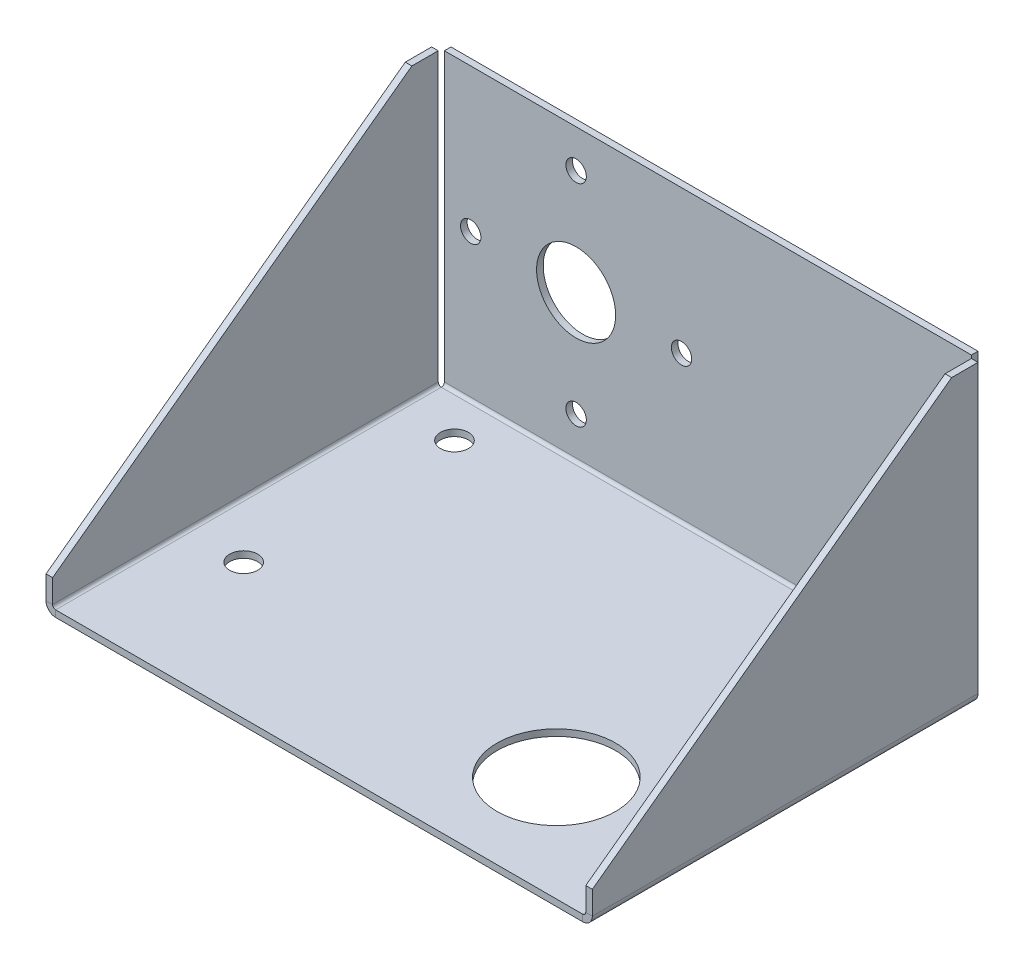
ISO-10303-21;
HEADER;
FILE_DESCRIPTION(('STEP AP214'),'2;1');
FILE_NAME('part.step','',(''),(''),'','','');
FILE_SCHEMA(('AUTOMOTIVE_DESIGN { 1 0 10303 214 1 1 1 1 }'));
ENDSEC;
DATA;
#1=APPLICATION_CONTEXT('core data for automotive mechanical design processes');
#2=APPLICATION_PROTOCOL_DEFINITION('international standard','automotive_design',2000,#1);
#3=PRODUCT_CONTEXT('',#1,'mechanical');
#4=PRODUCT('Part','Part','',(#3));
#5=PRODUCT_RELATED_PRODUCT_CATEGORY('part','',(#4));
#6=PRODUCT_DEFINITION_FORMATION('','',#4);
#7=PRODUCT_DEFINITION_CONTEXT('part definition',#1,'design');
#8=PRODUCT_DEFINITION('design','',#6,#7);
#9=PRODUCT_DEFINITION_SHAPE('','',#8);
#10=(LENGTH_UNIT() NAMED_UNIT(*) SI_UNIT(.MILLI.,.METRE.));
#11=(NAMED_UNIT(*) PLANE_ANGLE_UNIT() SI_UNIT($,.RADIAN.));
#12=(NAMED_UNIT(*) SI_UNIT($,.STERADIAN.) SOLID_ANGLE_UNIT());
#13=UNCERTAINTY_MEASURE_WITH_UNIT(LENGTH_MEASURE(1.E-05),#10,'distance_accuracy_value','');
#14=(GEOMETRIC_REPRESENTATION_CONTEXT(3) GLOBAL_UNCERTAINTY_ASSIGNED_CONTEXT((#13)) GLOBAL_UNIT_ASSIGNED_CONTEXT((#10,
#11,#12)) REPRESENTATION_CONTEXT('',''));
#15=CARTESIAN_POINT('',(0.,0.,0.));
#16=DIRECTION('',(0.,0.,1.));
#17=DIRECTION('',(1.,0.,0.));
#18=AXIS2_PLACEMENT_3D('',#15,#16,#17);
#19=CARTESIAN_POINT('',(127.,0.7366,-93.6625));
#20=DIRECTION('',(1.,0.,0.));
#21=DIRECTION('',(0.,0.,-1.));
#22=AXIS2_PLACEMENT_3D('',#19,#20,#21);
#23=PLANE('',#22);
#24=DIRECTION('',(0.,0.,-1.));
#25=VECTOR('',#24,1.);
#26=CARTESIAN_POINT('',(127.,0.7366,-93.6625));
#27=LINE('',#26,#25);
#28=CARTESIAN_POINT('',(127.,0.7366,-93.6625));
#29=VERTEX_POINT('',#28);
#30=CARTESIAN_POINT('',(127.,0.7366,-95.25));
#31=VERTEX_POINT('',#30);
#32=EDGE_CURVE('E13',#29,#31,#27,.T.);
#33=ORIENTED_EDGE('',*,*,#32,.F.);
#34=CARTESIAN_POINT('',(127.,0.7366,-92.9259));
#35=DIRECTION('',(-1.,0.,0.));
#36=DIRECTION('',(0.,0.,1.));
#37=AXIS2_PLACEMENT_3D('',#34,#35,#36);
#38=CIRCLE('',#37,0.7366);
#39=CARTESIAN_POINT('',(127.,0.,-92.9258999999999));
#40=VERTEX_POINT('',#39);
#41=EDGE_CURVE('E192',#40,#29,#38,.F.);
#42=ORIENTED_EDGE('',*,*,#41,.F.);
#43=DIRECTION('',(0.,1.,0.));
#44=VECTOR('',#43,1.);
#45=CARTESIAN_POINT('',(127.,-1.5875,-92.9258999999998));
#46=LINE('',#45,#44);
#47=CARTESIAN_POINT('',(127.,-1.58749999999997,-92.9258999999999));
#48=VERTEX_POINT('',#47);
#49=EDGE_CURVE('E98',#48,#40,#46,.T.);
#50=ORIENTED_EDGE('',*,*,#49,.F.);
#51=CARTESIAN_POINT('',(127.,0.7366,-92.9259));
#52=DIRECTION('',(1.,0.,0.));
#53=DIRECTION('',(0.,0.,-1.));
#54=AXIS2_PLACEMENT_3D('',#51,#52,#53);
#55=CIRCLE('',#54,2.3241);
#56=EDGE_CURVE('E274',#48,#31,#55,.T.);
#57=ORIENTED_EDGE('',*,*,#56,.T.);
#58=EDGE_LOOP('',(#33,#42,#50,#57));
#59=FACE_BOUND('',#58,.T.);
#60=ADVANCED_FACE('F89',(#59),#23,.T.);
#61=CARTESIAN_POINT('',(127.,-1.5875,-92.9258999999998));
#62=DIRECTION('',(1.,0.,0.));
#63=DIRECTION('',(0.,0.,-1.));
#64=AXIS2_PLACEMENT_3D('',#61,#62,#63);
#65=PLANE('',#64);
#66=DIRECTION('',(0.,1.,0.));
#67=VECTOR('',#66,1.);
#68=CARTESIAN_POINT('',(127.,0.,-93.6625));
#69=LINE('',#68,#67);
#70=CARTESIAN_POINT('',(127.,69.85,-93.6625));
#71=VERTEX_POINT('',#70);
#72=EDGE_CURVE('E267',#29,#71,#69,.T.);
#73=ORIENTED_EDGE('',*,*,#72,.F.);
#74=ORIENTED_EDGE('',*,*,#32,.T.);
#75=DIRECTION('',(0.,1.,0.));
#76=VECTOR('',#75,1.);
#77=CARTESIAN_POINT('',(127.,0.,-95.25));
#78=LINE('',#77,#76);
#79=CARTESIAN_POINT('',(127.,69.85,-95.25));
#80=VERTEX_POINT('',#79);
#81=EDGE_CURVE('E139',#31,#80,#78,.T.);
#82=ORIENTED_EDGE('',*,*,#81,.T.);
#83=DIRECTION('',(0.,0.,-1.));
#84=VECTOR('',#83,1.);
#85=CARTESIAN_POINT('',(127.,69.85,-93.6625));
#86=LINE('',#85,#84);
#87=EDGE_CURVE('E263',#71,#80,#86,.T.);
#88=ORIENTED_EDGE('',*,*,#87,.F.);
#89=EDGE_LOOP('',(#73,#74,#82,#88));
#90=FACE_BOUND('',#89,.T.);
#91=ADVANCED_FACE('F358',(#90),#65,.T.);
#92=CARTESIAN_POINT('',(0.,0.,-92.9258999999999));
#93=DIRECTION('',(-1.,0.,0.));
#94=DIRECTION('',(0.,0.,1.));
#95=AXIS2_PLACEMENT_3D('',#92,#93,#94);
#96=PLANE('',#95);
#97=DIRECTION('',(0.,-1.,0.));
#98=VECTOR('',#97,1.);
#99=CARTESIAN_POINT('',(0.,0.,-92.9258999999999));
#100=LINE('',#99,#98);
#101=CARTESIAN_POINT('',(0.,0.,-92.9258999999999));
#102=VERTEX_POINT('',#101);
#103=CARTESIAN_POINT('',(0.,-1.5875,-92.9258999999998));
#104=VERTEX_POINT('',#103);
#105=EDGE_CURVE('E310',#102,#104,#100,.T.);
#106=ORIENTED_EDGE('',*,*,#105,.F.);
#107=CARTESIAN_POINT('',(0.,0.7366,-92.9259));
#108=DIRECTION('',(-1.,0.,0.));
#109=DIRECTION('',(0.,0.,1.));
#110=AXIS2_PLACEMENT_3D('',#107,#108,#109);
#111=CIRCLE('',#110,0.7366);
#112=CARTESIAN_POINT('',(0.,0.7366,-93.6625));
#113=VERTEX_POINT('',#112);
#114=EDGE_CURVE('E285',#102,#113,#111,.F.);
#115=ORIENTED_EDGE('',*,*,#114,.T.);
#116=DIRECTION('',(0.,0.,1.));
#117=VECTOR('',#116,1.);
#118=CARTESIAN_POINT('',(0.,0.7366,-95.25));
#119=LINE('',#118,#117);
#120=CARTESIAN_POINT('',(0.,0.7366,-95.25));
#121=VERTEX_POINT('',#120);
#122=EDGE_CURVE('E133',#121,#113,#119,.T.);
#123=ORIENTED_EDGE('',*,*,#122,.F.);
#124=CARTESIAN_POINT('',(0.,0.7366,-92.9259));
#125=DIRECTION('',(1.,0.,0.));
#126=DIRECTION('',(0.,0.,-1.));
#127=AXIS2_PLACEMENT_3D('',#124,#125,#126);
#128=CIRCLE('',#127,2.3241);
#129=EDGE_CURVE('E264',#104,#121,#128,.T.);
#130=ORIENTED_EDGE('',*,*,#129,.F.);
#131=EDGE_LOOP('',(#106,#115,#123,#130));
#132=FACE_BOUND('',#131,.T.);
#133=ADVANCED_FACE('F337',(#132),#96,.T.);
#134=CARTESIAN_POINT('',(127.,0.,-95.25));
#135=DIRECTION('',(0.,0.,1.));
#136=DIRECTION('',(1.,0.,0.));
#137=AXIS2_PLACEMENT_3D('',#134,#135,#136);
#138=PLANE('',#137);
#139=CARTESIAN_POINT('',(31.75,60.6933,-95.25));
#140=DIRECTION('',(0.,0.,-1.));
#141=DIRECTION('',(-1.,0.,0.));
#142=AXIS2_PLACEMENT_3D('',#139,#140,#141);
#143=CIRCLE('',#142,2.45745);
#144=CARTESIAN_POINT('',(29.29255,60.6933,-95.25));
#145=VERTEX_POINT('',#144);
#146=EDGE_CURVE('E505',#145,#145,#143,.T.);
#147=ORIENTED_EDGE('',*,*,#146,.F.);
#148=EDGE_LOOP('',(#147));
#149=FACE_BOUND('',#148,.T.);
#150=CARTESIAN_POINT('',(6.35,35.2933,-95.25));
#151=DIRECTION('',(0.,0.,-1.));
#152=DIRECTION('',(-1.,0.,0.));
#153=AXIS2_PLACEMENT_3D('',#150,#151,#152);
#154=CIRCLE('',#153,2.45745);
#155=CARTESIAN_POINT('',(3.89255,35.2933,-95.25));
#156=VERTEX_POINT('',#155);
#157=EDGE_CURVE('E507',#156,#156,#154,.T.);
#158=ORIENTED_EDGE('',*,*,#157,.F.);
#159=EDGE_LOOP('',(#158));
#160=FACE_BOUND('',#159,.T.);
#161=CARTESIAN_POINT('',(31.75,9.8933,-95.25));
#162=DIRECTION('',(0.,0.,-1.));
#163=DIRECTION('',(-1.,0.,0.));
#164=AXIS2_PLACEMENT_3D('',#161,#162,#163);
#165=CIRCLE('',#164,2.45745);
#166=CARTESIAN_POINT('',(29.29255,9.8933,-95.25));
#167=VERTEX_POINT('',#166);
#168=EDGE_CURVE('E515',#167,#167,#165,.T.);
#169=ORIENTED_EDGE('',*,*,#168,.F.);
#170=EDGE_LOOP('',(#169));
#171=FACE_BOUND('',#170,.T.);
#172=CARTESIAN_POINT('',(57.15,35.2933,-95.25));
#173=DIRECTION('',(0.,0.,-1.));
#174=DIRECTION('',(-1.,0.,0.));
#175=AXIS2_PLACEMENT_3D('',#172,#173,#174);
#176=CIRCLE('',#175,2.45745);
#177=CARTESIAN_POINT('',(54.69255,35.2933,-95.25));
#178=VERTEX_POINT('',#177);
#179=EDGE_CURVE('E518',#178,#178,#176,.T.);
#180=ORIENTED_EDGE('',*,*,#179,.F.);
#181=EDGE_LOOP('',(#180));
#182=FACE_BOUND('',#181,.T.);
#183=CARTESIAN_POINT('',(31.75,35.2933,-95.25));
#184=DIRECTION('',(0.,0.,1.));
#185=DIRECTION('',(1.,0.,0.));
#186=AXIS2_PLACEMENT_3D('',#183,#184,#185);
#187=CIRCLE('',#186,9.52499999999999);
#188=CARTESIAN_POINT('',(41.275,35.2933,-95.25));
#189=VERTEX_POINT('',#188);
#190=EDGE_CURVE('E525',#189,#189,#187,.T.);
#191=ORIENTED_EDGE('',*,*,#190,.T.);
#192=EDGE_LOOP('',(#191));
#193=FACE_BOUND('',#192,.T.);
#194=DIRECTION('',(0.,1.,0.));
#195=VECTOR('',#194,1.);
#196=CARTESIAN_POINT('',(0.,0.,-95.25));
#197=LINE('',#196,#195);
#198=CARTESIAN_POINT('',(0.,69.85,-95.25));
#199=VERTEX_POINT('',#198);
#200=EDGE_CURVE('E253',#121,#199,#197,.T.);
#201=ORIENTED_EDGE('',*,*,#200,.T.);
#202=DIRECTION('',(-1.,0.,0.));
#203=VECTOR('',#202,1.);
#204=CARTESIAN_POINT('',(127.,69.85,-95.25));
#205=LINE('',#204,#203);
#206=EDGE_CURVE('E307',#80,#199,#205,.T.);
#207=ORIENTED_EDGE('',*,*,#206,.F.);
#208=ORIENTED_EDGE('',*,*,#81,.F.);
#209=DIRECTION('',(-1.,0.,0.));
#210=VECTOR('',#209,1.);
#211=CARTESIAN_POINT('',(127.,0.7366,-95.25));
#212=LINE('',#211,#210);
#213=EDGE_CURVE('E276',#31,#121,#212,.T.);
#214=ORIENTED_EDGE('',*,*,#213,.T.);
#215=EDGE_LOOP('',(#201,#207,#208,#214));
#216=FACE_BOUND('',#215,.T.);
#217=ADVANCED_FACE('F355',(#149,#160,#171,#182,#193,#216),#138,.F.);
#218=CARTESIAN_POINT('',(127.,69.85,-93.6625));
#219=DIRECTION('',(0.,1.,0.));
#220=DIRECTION('',(0.,0.,1.));
#221=AXIS2_PLACEMENT_3D('',#218,#219,#220);
#222=PLANE('',#221);
#223=DIRECTION('',(0.,0.,-1.));
#224=VECTOR('',#223,1.);
#225=CARTESIAN_POINT('',(0.,69.85,-93.6625));
#226=LINE('',#225,#224);
#227=CARTESIAN_POINT('',(0.,69.85,-93.6625));
#228=VERTEX_POINT('',#227);
#229=EDGE_CURVE('E279',#228,#199,#226,.T.);
#230=ORIENTED_EDGE('',*,*,#229,.F.);
#231=DIRECTION('',(-1.,0.,0.));
#232=VECTOR('',#231,1.);
#233=CARTESIAN_POINT('',(127.,69.85,-93.6625));
#234=LINE('',#233,#232);
#235=EDGE_CURVE('E305',#71,#228,#234,.T.);
#236=ORIENTED_EDGE('',*,*,#235,.F.);
#237=ORIENTED_EDGE('',*,*,#87,.T.);
#238=ORIENTED_EDGE('',*,*,#206,.T.);
#239=EDGE_LOOP('',(#230,#236,#237,#238));
#240=FACE_BOUND('',#239,.T.);
#241=ADVANCED_FACE('F357',(#240),#222,.T.);
#242=CARTESIAN_POINT('',(127.,0.,-93.6625));
#243=DIRECTION('',(0.,0.,1.));
#244=DIRECTION('',(1.,0.,0.));
#245=AXIS2_PLACEMENT_3D('',#242,#243,#244);
#246=PLANE('',#245);
#247=CARTESIAN_POINT('',(31.75,60.6933,-93.6625));
#248=DIRECTION('',(0.,0.,1.));
#249=DIRECTION('',(1.,0.,0.));
#250=AXIS2_PLACEMENT_3D('',#247,#248,#249);
#251=CIRCLE('',#250,2.45744999999999);
#252=CARTESIAN_POINT('',(34.20745,60.6933,-93.6625));
#253=VERTEX_POINT('',#252);
#254=EDGE_CURVE('E502',#253,#253,#251,.T.);
#255=ORIENTED_EDGE('',*,*,#254,.F.);
#256=EDGE_LOOP('',(#255));
#257=FACE_BOUND('',#256,.T.);
#258=CARTESIAN_POINT('',(6.35,35.2933,-93.6625));
#259=DIRECTION('',(0.,0.,1.));
#260=DIRECTION('',(1.,0.,0.));
#261=AXIS2_PLACEMENT_3D('',#258,#259,#260);
#262=CIRCLE('',#261,2.45744999999999);
#263=CARTESIAN_POINT('',(8.80744999999999,35.2933,-93.6625));
#264=VERTEX_POINT('',#263);
#265=EDGE_CURVE('E512',#264,#264,#262,.T.);
#266=ORIENTED_EDGE('',*,*,#265,.F.);
#267=EDGE_LOOP('',(#266));
#268=FACE_BOUND('',#267,.T.);
#269=CARTESIAN_POINT('',(31.75,9.8933,-93.6625));
#270=DIRECTION('',(0.,0.,1.));
#271=DIRECTION('',(1.,0.,0.));
#272=AXIS2_PLACEMENT_3D('',#269,#270,#271);
#273=CIRCLE('',#272,2.45744999999999);
#274=CARTESIAN_POINT('',(34.20745,9.8933,-93.6625));
#275=VERTEX_POINT('',#274);
#276=EDGE_CURVE('E92',#275,#275,#273,.T.);
#277=ORIENTED_EDGE('',*,*,#276,.F.);
#278=EDGE_LOOP('',(#277));
#279=FACE_BOUND('',#278,.T.);
#280=CARTESIAN_POINT('',(57.15,35.2933,-93.6625));
#281=DIRECTION('',(0.,0.,1.));
#282=DIRECTION('',(1.,0.,0.));
#283=AXIS2_PLACEMENT_3D('',#280,#281,#282);
#284=CIRCLE('',#283,2.45744999999999);
#285=CARTESIAN_POINT('',(59.60745,35.2933,-93.6625));
#286=VERTEX_POINT('',#285);
#287=EDGE_CURVE('E521',#286,#286,#284,.T.);
#288=ORIENTED_EDGE('',*,*,#287,.F.);
#289=EDGE_LOOP('',(#288));
#290=FACE_BOUND('',#289,.T.);
#291=CARTESIAN_POINT('',(31.75,35.2933,-93.6625));
#292=DIRECTION('',(0.,0.,1.));
#293=DIRECTION('',(1.,0.,0.));
#294=AXIS2_PLACEMENT_3D('',#291,#292,#293);
#295=CIRCLE('',#294,9.52499999999999);
#296=CARTESIAN_POINT('',(41.275,35.2933,-93.6625));
#297=VERTEX_POINT('',#296);
#298=EDGE_CURVE('E524',#297,#297,#295,.T.);
#299=ORIENTED_EDGE('',*,*,#298,.F.);
#300=EDGE_LOOP('',(#299));
#301=FACE_BOUND('',#300,.T.);
#302=DIRECTION('',(0.,1.,0.));
#303=VECTOR('',#302,1.);
#304=CARTESIAN_POINT('',(0.,0.,-93.6625));
#305=LINE('',#304,#303);
#306=EDGE_CURVE('E282',#113,#228,#305,.T.);
#307=ORIENTED_EDGE('',*,*,#306,.F.);
#308=DIRECTION('',(-1.,0.,0.));
#309=VECTOR('',#308,1.);
#310=CARTESIAN_POINT('',(127.,0.7366,-93.6625));
#311=LINE('',#310,#309);
#312=EDGE_CURVE('E302',#29,#113,#311,.T.);
#313=ORIENTED_EDGE('',*,*,#312,.F.);
#314=ORIENTED_EDGE('',*,*,#72,.T.);
#315=ORIENTED_EDGE('',*,*,#235,.T.);
#316=EDGE_LOOP('',(#307,#313,#314,#315));
#317=FACE_BOUND('',#316,.T.);
#318=ADVANCED_FACE('F349',(#257,#268,#279,#290,#301,#317),#246,.T.);
#319=CARTESIAN_POINT('',(127.,0.7366,-92.9259));
#320=DIRECTION('',(-1.,0.,0.));
#321=DIRECTION('',(0.,0.,1.));
#322=AXIS2_PLACEMENT_3D('',#319,#320,#321);
#323=CYLINDRICAL_SURFACE('',#322,0.7366);
#324=ORIENTED_EDGE('',*,*,#114,.F.);
#325=DIRECTION('',(-1.,0.,0.));
#326=VECTOR('',#325,1.);
#327=CARTESIAN_POINT('',(127.,0.,-92.9258999999999));
#328=LINE('',#327,#326);
#329=EDGE_CURVE('E168',#40,#102,#328,.T.);
#330=ORIENTED_EDGE('',*,*,#329,.F.);
#331=ORIENTED_EDGE('',*,*,#41,.T.);
#332=ORIENTED_EDGE('',*,*,#312,.T.);
#333=EDGE_LOOP('',(#324,#330,#331,#332));
#334=FACE_BOUND('',#333,.T.);
#335=ADVANCED_FACE('F345',(#334),#323,.F.);
#336=CARTESIAN_POINT('',(127.,0.,0.));
#337=DIRECTION('',(0.,1.,0.));
#338=DIRECTION('',(0.,0.,1.));
#339=AXIS2_PLACEMENT_3D('',#336,#337,#338);
#340=PLANE('',#339);
#341=CARTESIAN_POINT('',(12.7,0.,-32.6008999999999));
#342=DIRECTION('',(0.,1.,0.));
#343=DIRECTION('',(0.,0.,1.));
#344=AXIS2_PLACEMENT_3D('',#341,#342,#343);
#345=CIRCLE('',#344,3.3782);
#346=CARTESIAN_POINT('',(12.7,0.,-29.2226999999999));
#347=VERTEX_POINT('',#346);
#348=EDGE_CURVE('E528',#347,#347,#345,.T.);
#349=ORIENTED_EDGE('',*,*,#348,.F.);
#350=EDGE_LOOP('',(#349));
#351=FACE_BOUND('',#350,.T.);
#352=CARTESIAN_POINT('',(121.92,0.,-32.6008999999999));
#353=DIRECTION('',(0.,1.,0.));
#354=DIRECTION('',(0.,0.,1.));
#355=AXIS2_PLACEMENT_3D('',#352,#353,#354);
#356=CIRCLE('',#355,3.37819999999999);
#357=CARTESIAN_POINT('',(121.92,0.,-29.2226999999999));
#358=VERTEX_POINT('',#357);
#359=EDGE_CURVE('E541',#358,#358,#356,.T.);
#360=ORIENTED_EDGE('',*,*,#359,.F.);
#361=EDGE_LOOP('',(#360));
#362=FACE_BOUND('',#361,.T.);
#363=CARTESIAN_POINT('',(121.92,0.,-83.4008999999999));
#364=DIRECTION('',(0.,1.,0.));
#365=DIRECTION('',(0.,0.,1.));
#366=AXIS2_PLACEMENT_3D('',#363,#364,#365);
#367=CIRCLE('',#366,3.37819999999999);
#368=CARTESIAN_POINT('',(121.92,0.,-80.0226999999999));
#369=VERTEX_POINT('',#368);
#370=EDGE_CURVE('E535',#369,#369,#367,.T.);
#371=ORIENTED_EDGE('',*,*,#370,.F.);
#372=EDGE_LOOP('',(#371));
#373=FACE_BOUND('',#372,.T.);
#374=CARTESIAN_POINT('',(12.7,0.,-83.4008999999999));
#375=DIRECTION('',(0.,1.,0.));
#376=DIRECTION('',(0.,0.,1.));
#377=AXIS2_PLACEMENT_3D('',#374,#375,#376);
#378=CIRCLE('',#377,3.37819999999998);
#379=CARTESIAN_POINT('',(12.7,0.,-80.0226999999999));
#380=VERTEX_POINT('',#379);
#381=EDGE_CURVE('E534',#380,#380,#378,.T.);
#382=ORIENTED_EDGE('',*,*,#381,.F.);
#383=EDGE_LOOP('',(#382));
#384=FACE_BOUND('',#383,.T.);
#385=CARTESIAN_POINT('',(95.25,0.,-25.4));
#386=DIRECTION('',(0.,1.,0.));
#387=DIRECTION('',(0.,0.,1.));
#388=AXIS2_PLACEMENT_3D('',#385,#386,#387);
#389=CIRCLE('',#388,14.2875);
#390=CARTESIAN_POINT('',(95.25,0.,-11.1125));
#391=VERTEX_POINT('',#390);
#392=EDGE_CURVE('E552',#391,#391,#389,.T.);
#393=ORIENTED_EDGE('',*,*,#392,.F.);
#394=EDGE_LOOP('',(#393));
#395=FACE_BOUND('',#394,.T.);
#396=DIRECTION('',(0.,0.,-1.));
#397=VECTOR('',#396,1.);
#398=CARTESIAN_POINT('',(0.,0.,0.));
#399=LINE('',#398,#397);
#400=CARTESIAN_POINT('',(0.,0.,0.));
#401=VERTEX_POINT('',#400);
#402=EDGE_CURVE('E165',#401,#102,#399,.T.);
#403=ORIENTED_EDGE('',*,*,#402,.F.);
#404=DIRECTION('',(-1.,0.,0.));
#405=VECTOR('',#404,1.);
#406=CARTESIAN_POINT('',(127.,0.,0.));
#407=LINE('',#406,#405);
#408=CARTESIAN_POINT('',(127.,0.,0.));
#409=VERTEX_POINT('',#408);
#410=EDGE_CURVE('E156',#409,#401,#407,.T.);
#411=ORIENTED_EDGE('',*,*,#410,.F.);
#412=DIRECTION('',(0.,0.,-1.));
#413=VECTOR('',#412,1.);
#414=CARTESIAN_POINT('',(127.,0.,0.));
#415=LINE('',#414,#413);
#416=EDGE_CURVE('E161',#409,#40,#415,.T.);
#417=ORIENTED_EDGE('',*,*,#416,.T.);
#418=ORIENTED_EDGE('',*,*,#329,.T.);
#419=EDGE_LOOP('',(#403,#411,#417,#418));
#420=FACE_BOUND('',#419,.T.);
#421=ADVANCED_FACE('F158',(#351,#362,#373,#384,#395,#420),#340,.T.);
#422=CARTESIAN_POINT('',(127.,-1.5875,0.));
#423=DIRECTION('',(0.,0.,1.));
#424=DIRECTION('',(1.,0.,0.));
#425=AXIS2_PLACEMENT_3D('',#422,#423,#424);
#426=PLANE('',#425);
#427=DIRECTION('',(0.,1.,0.));
#428=VECTOR('',#427,1.);
#429=CARTESIAN_POINT('',(0.,-1.5875,0.));
#430=LINE('',#429,#428);
#431=CARTESIAN_POINT('',(0.,-1.5875,0.));
#432=VERTEX_POINT('',#431);
#433=EDGE_CURVE('E288',#432,#401,#430,.T.);
#434=ORIENTED_EDGE('',*,*,#433,.F.);
#435=DIRECTION('',(-1.,0.,0.));
#436=VECTOR('',#435,1.);
#437=CARTESIAN_POINT('',(127.,-1.5875,0.));
#438=LINE('',#437,#436);
#439=CARTESIAN_POINT('',(127.,-1.5875,0.));
#440=VERTEX_POINT('',#439);
#441=EDGE_CURVE('E169',#440,#432,#438,.T.);
#442=ORIENTED_EDGE('',*,*,#441,.F.);
#443=DIRECTION('',(0.,1.,0.));
#444=VECTOR('',#443,1.);
#445=CARTESIAN_POINT('',(127.,-1.5875,0.));
#446=LINE('',#445,#444);
#447=EDGE_CURVE('E172',#440,#409,#446,.T.);
#448=ORIENTED_EDGE('',*,*,#447,.T.);
#449=ORIENTED_EDGE('',*,*,#410,.T.);
#450=EDGE_LOOP('',(#434,#442,#448,#449));
#451=FACE_BOUND('',#450,.T.);
#452=ADVANCED_FACE('F173',(#451),#426,.T.);
#453=CARTESIAN_POINT('',(127.,-1.5875,0.));
#454=DIRECTION('',(0.,1.,0.));
#455=DIRECTION('',(0.,0.,1.));
#456=AXIS2_PLACEMENT_3D('',#453,#454,#455);
#457=PLANE('',#456);
#458=CARTESIAN_POINT('',(12.7,-1.5875,-32.6008999999999));
#459=DIRECTION('',(0.,1.,0.));
#460=DIRECTION('',(0.,0.,1.));
#461=AXIS2_PLACEMENT_3D('',#458,#459,#460);
#462=CIRCLE('',#461,3.3782);
#463=CARTESIAN_POINT('',(12.7,-1.5875,-29.2226999999999));
#464=VERTEX_POINT('',#463);
#465=EDGE_CURVE('E544',#464,#464,#462,.T.);
#466=ORIENTED_EDGE('',*,*,#465,.T.);
#467=EDGE_LOOP('',(#466));
#468=FACE_BOUND('',#467,.T.);
#469=CARTESIAN_POINT('',(121.92,-1.5875,-32.6008999999999));
#470=DIRECTION('',(0.,1.,0.));
#471=DIRECTION('',(0.,0.,1.));
#472=AXIS2_PLACEMENT_3D('',#469,#470,#471);
#473=CIRCLE('',#472,3.37819999999999);
#474=CARTESIAN_POINT('',(121.92,-1.5875,-29.2226999999999));
#475=VERTEX_POINT('',#474);
#476=EDGE_CURVE('E538',#475,#475,#473,.T.);
#477=ORIENTED_EDGE('',*,*,#476,.T.);
#478=EDGE_LOOP('',(#477));
#479=FACE_BOUND('',#478,.T.);
#480=CARTESIAN_POINT('',(121.92,-1.5875,-83.4008999999999));
#481=DIRECTION('',(0.,1.,0.));
#482=DIRECTION('',(0.,0.,1.));
#483=AXIS2_PLACEMENT_3D('',#480,#481,#482);
#484=CIRCLE('',#483,3.37819999999999);
#485=CARTESIAN_POINT('',(121.92,-1.5875,-80.0226999999999));
#486=VERTEX_POINT('',#485);
#487=EDGE_CURVE('E531',#486,#486,#484,.T.);
#488=ORIENTED_EDGE('',*,*,#487,.T.);
#489=EDGE_LOOP('',(#488));
#490=FACE_BOUND('',#489,.T.);
#491=CARTESIAN_POINT('',(12.7,-1.5875,-83.4008999999999));
#492=DIRECTION('',(0.,1.,0.));
#493=DIRECTION('',(0.,0.,1.));
#494=AXIS2_PLACEMENT_3D('',#491,#492,#493);
#495=CIRCLE('',#494,3.37819999999998);
#496=CARTESIAN_POINT('',(12.7,-1.5875,-80.0226999999999));
#497=VERTEX_POINT('',#496);
#498=EDGE_CURVE('E549',#497,#497,#495,.T.);
#499=ORIENTED_EDGE('',*,*,#498,.T.);
#500=EDGE_LOOP('',(#499));
#501=FACE_BOUND('',#500,.T.);
#502=CARTESIAN_POINT('',(95.25,-1.5875,-25.4));
#503=DIRECTION('',(0.,1.,0.));
#504=DIRECTION('',(0.,0.,1.));
#505=AXIS2_PLACEMENT_3D('',#502,#503,#504);
#506=CIRCLE('',#505,14.2875);
#507=CARTESIAN_POINT('',(95.25,-1.5875,-11.1125));
#508=VERTEX_POINT('',#507);
#509=EDGE_CURVE('E555',#508,#508,#506,.T.);
#510=ORIENTED_EDGE('',*,*,#509,.T.);
#511=EDGE_LOOP('',(#510));
#512=FACE_BOUND('',#511,.T.);
#513=DIRECTION('',(0.,0.,-1.));
#514=VECTOR('',#513,1.);
#515=CARTESIAN_POINT('',(0.,-1.5875,0.));
#516=LINE('',#515,#514);
#517=EDGE_CURVE('E291',#432,#104,#516,.T.);
#518=ORIENTED_EDGE('',*,*,#517,.T.);
#519=DIRECTION('',(-1.,0.,0.));
#520=VECTOR('',#519,1.);
#521=CARTESIAN_POINT('',(127.,-1.5875,-92.9258999999998));
#522=LINE('',#521,#520);
#523=EDGE_CURVE('E297',#48,#104,#522,.T.);
#524=ORIENTED_EDGE('',*,*,#523,.F.);
#525=DIRECTION('',(0.,0.,-1.));
#526=VECTOR('',#525,1.);
#527=CARTESIAN_POINT('',(127.,-1.5875,0.));
#528=LINE('',#527,#526);
#529=EDGE_CURVE('E180',#440,#48,#528,.T.);
#530=ORIENTED_EDGE('',*,*,#529,.F.);
#531=ORIENTED_EDGE('',*,*,#441,.T.);
#532=EDGE_LOOP('',(#518,#524,#530,#531));
#533=FACE_BOUND('',#532,.T.);
#534=ADVANCED_FACE('F333',(#468,#479,#490,#501,#512,#533),#457,.F.);
#535=CARTESIAN_POINT('',(127.,0.7366,-92.9259));
#536=DIRECTION('',(-1.,0.,0.));
#537=DIRECTION('',(0.,0.,1.));
#538=AXIS2_PLACEMENT_3D('',#535,#536,#537);
#539=CYLINDRICAL_SURFACE('',#538,2.3241);
#540=ORIENTED_EDGE('',*,*,#129,.T.);
#541=ORIENTED_EDGE('',*,*,#213,.F.);
#542=ORIENTED_EDGE('',*,*,#56,.F.);
#543=ORIENTED_EDGE('',*,*,#523,.T.);
#544=EDGE_LOOP('',(#540,#541,#542,#543));
#545=FACE_BOUND('',#544,.T.);
#546=ADVANCED_FACE('F335',(#545),#539,.T.);
#547=CARTESIAN_POINT('',(0.,0.7366,-92.9259));
#548=DIRECTION('',(-1.,0.,0.));
#549=DIRECTION('',(0.,0.,1.));
#550=AXIS2_PLACEMENT_3D('',#547,#548,#549);
#551=PLANE('',#550);
#552=ORIENTED_EDGE('',*,*,#200,.F.);
#553=ORIENTED_EDGE('',*,*,#122,.T.);
#554=ORIENTED_EDGE('',*,*,#306,.T.);
#555=ORIENTED_EDGE('',*,*,#229,.T.);
#556=EDGE_LOOP('',(#552,#553,#554,#555));
#557=FACE_BOUND('',#556,.T.);
#558=ADVANCED_FACE('F353',(#557),#551,.T.);
#559=CARTESIAN_POINT('',(0.,0.7366,-92.9258999999999));
#560=DIRECTION('',(0.,0.,-1.));
#561=DIRECTION('',(-1.,0.,0.));
#562=AXIS2_PLACEMENT_3D('',#559,#560,#561);
#563=PLANE('',#562);
#564=DIRECTION('',(1.,0.,0.));
#565=VECTOR('',#564,1.);
#566=CARTESIAN_POINT('',(-2.3241,0.736599999999992,-92.9258999999999));
#567=LINE('',#566,#565);
#568=CARTESIAN_POINT('',(-0.7366,0.736599999999997,-92.9258999999999));
#569=VERTEX_POINT('',#568);
#570=CARTESIAN_POINT('',(-2.3241,0.736599999999992,-92.9258999999999));
#571=VERTEX_POINT('',#570);
#572=EDGE_CURVE('E249',#569,#571,#567,.F.);
#573=ORIENTED_EDGE('',*,*,#572,.F.);
#574=CARTESIAN_POINT('',(0.,0.7366,-92.9258999999999));
#575=DIRECTION('',(0.,0.,1.));
#576=DIRECTION('',(1.,0.,0.));
#577=AXIS2_PLACEMENT_3D('',#574,#575,#576);
#578=CIRCLE('',#577,0.736599999999997);
#579=EDGE_CURVE('E257',#102,#569,#578,.F.);
#580=ORIENTED_EDGE('',*,*,#579,.F.);
#581=ORIENTED_EDGE('',*,*,#105,.T.);
#582=CARTESIAN_POINT('',(0.,0.7366,-92.9258999999999));
#583=DIRECTION('',(0.,0.,1.));
#584=DIRECTION('',(1.,0.,0.));
#585=AXIS2_PLACEMENT_3D('',#582,#583,#584);
#586=CIRCLE('',#585,2.3241);
#587=EDGE_CURVE('E126',#104,#571,#586,.F.);
#588=ORIENTED_EDGE('',*,*,#587,.T.);
#589=EDGE_LOOP('',(#573,#580,#581,#588));
#590=FACE_BOUND('',#589,.T.);
#591=ADVANCED_FACE('F388',(#590),#563,.T.);
#592=CARTESIAN_POINT('',(0.,0.7366,0.));
#593=DIRECTION('',(0.,0.,-1.));
#594=DIRECTION('',(-1.,0.,0.));
#595=AXIS2_PLACEMENT_3D('',#592,#593,#594);
#596=PLANE('',#595);
#597=CARTESIAN_POINT('',(0.,0.7366,0.));
#598=DIRECTION('',(0.,0.,1.));
#599=DIRECTION('',(1.,0.,0.));
#600=AXIS2_PLACEMENT_3D('',#597,#598,#599);
#601=CIRCLE('',#600,0.736599999999997);
#602=CARTESIAN_POINT('',(-0.736599999999993,0.736599999999997,0.));
#603=VERTEX_POINT('',#602);
#604=EDGE_CURVE('E210',#603,#401,#601,.T.);
#605=ORIENTED_EDGE('',*,*,#604,.F.);
#606=DIRECTION('',(1.,0.,0.));
#607=VECTOR('',#606,1.);
#608=CARTESIAN_POINT('',(-0.7366,0.736599999999997,0.));
#609=LINE('',#608,#607);
#610=CARTESIAN_POINT('',(-2.3241,0.736599999999992,0.));
#611=VERTEX_POINT('',#610);
#612=EDGE_CURVE('E243',#603,#611,#609,.F.);
#613=ORIENTED_EDGE('',*,*,#612,.T.);
#614=CARTESIAN_POINT('',(0.,0.7366,0.));
#615=DIRECTION('',(0.,0.,1.));
#616=DIRECTION('',(1.,0.,0.));
#617=AXIS2_PLACEMENT_3D('',#614,#615,#616);
#618=CIRCLE('',#617,2.3241);
#619=EDGE_CURVE('E254',#611,#432,#618,.T.);
#620=ORIENTED_EDGE('',*,*,#619,.T.);
#621=ORIENTED_EDGE('',*,*,#433,.T.);
#622=EDGE_LOOP('',(#605,#613,#620,#621));
#623=FACE_BOUND('',#622,.T.);
#624=ADVANCED_FACE('F389',(#623),#596,.F.);
#625=CARTESIAN_POINT('',(0.,0.7366,0.));
#626=DIRECTION('',(0.,0.,1.));
#627=DIRECTION('',(-1.,0.,0.));
#628=AXIS2_PLACEMENT_3D('',#625,#626,#627);
#629=CYLINDRICAL_SURFACE('',#628,2.3241);
#630=ORIENTED_EDGE('',*,*,#517,.F.);
#631=ORIENTED_EDGE('',*,*,#619,.F.);
#632=DIRECTION('',(0.,0.,1.));
#633=VECTOR('',#632,1.);
#634=CARTESIAN_POINT('',(-2.3241,0.736599999999992,-92.9258999999999));
#635=LINE('',#634,#633);
#636=EDGE_CURVE('E241',#611,#571,#635,.F.);
#637=ORIENTED_EDGE('',*,*,#636,.T.);
#638=ORIENTED_EDGE('',*,*,#587,.F.);
#639=EDGE_LOOP('',(#630,#631,#637,#638));
#640=FACE_BOUND('',#639,.T.);
#641=ADVANCED_FACE('F392',(#640),#629,.T.);
#642=CARTESIAN_POINT('',(0.,0.7366,0.));
#643=DIRECTION('',(0.,0.,1.));
#644=DIRECTION('',(-1.,0.,0.));
#645=AXIS2_PLACEMENT_3D('',#642,#643,#644);
#646=CYLINDRICAL_SURFACE('',#645,0.736599999999997);
#647=ORIENTED_EDGE('',*,*,#402,.T.);
#648=ORIENTED_EDGE('',*,*,#579,.T.);
#649=DIRECTION('',(0.,0.,1.));
#650=VECTOR('',#649,1.);
#651=CARTESIAN_POINT('',(-0.7366,0.736599999999997,-92.9258999999999));
#652=LINE('',#651,#650);
#653=EDGE_CURVE('E246',#569,#603,#652,.T.);
#654=ORIENTED_EDGE('',*,*,#653,.T.);
#655=ORIENTED_EDGE('',*,*,#604,.T.);
#656=EDGE_LOOP('',(#647,#648,#654,#655));
#657=FACE_BOUND('',#656,.T.);
#658=ADVANCED_FACE('F396',(#657),#646,.F.);
#659=CARTESIAN_POINT('',(-2.32410000000002,6.34999999999999,0.));
#660=DIRECTION('',(0.,0.,-1.));
#661=DIRECTION('',(-1.,0.,0.));
#662=AXIS2_PLACEMENT_3D('',#659,#660,#661);
#663=PLANE('',#662);
#664=ORIENTED_EDGE('',*,*,#612,.F.);
#665=DIRECTION('',(0.,-1.,0.));
#666=VECTOR('',#665,1.);
#667=CARTESIAN_POINT('',(-0.73660000000002,6.35,0.));
#668=LINE('',#667,#666);
#669=CARTESIAN_POINT('',(-0.73660000000002,6.35,0.));
#670=VERTEX_POINT('',#669);
#671=EDGE_CURVE('E238',#603,#670,#668,.F.);
#672=ORIENTED_EDGE('',*,*,#671,.T.);
#673=DIRECTION('',(1.,0.,0.));
#674=VECTOR('',#673,1.);
#675=CARTESIAN_POINT('',(-2.32410000000002,6.34999999999999,0.));
#676=LINE('',#675,#674);
#677=CARTESIAN_POINT('',(-2.32410000000002,6.34999999999999,0.));
#678=VERTEX_POINT('',#677);
#679=EDGE_CURVE('E207',#678,#670,#676,.T.);
#680=ORIENTED_EDGE('',*,*,#679,.F.);
#681=DIRECTION('',(0.,1.,0.));
#682=VECTOR('',#681,1.);
#683=CARTESIAN_POINT('',(-2.3241,0.,0.));
#684=LINE('',#683,#682);
#685=EDGE_CURVE('E226',#611,#678,#684,.T.);
#686=ORIENTED_EDGE('',*,*,#685,.F.);
#687=EDGE_LOOP('',(#664,#672,#680,#686));
#688=FACE_BOUND('',#687,.T.);
#689=ADVANCED_FACE('F399',(#688),#663,.F.);
#690=CARTESIAN_POINT('',(-2.3241,0.,-92.9258999999999));
#691=DIRECTION('',(0.,0.,1.));
#692=DIRECTION('',(1.,0.,0.));
#693=AXIS2_PLACEMENT_3D('',#690,#691,#692);
#694=PLANE('',#693);
#695=ORIENTED_EDGE('',*,*,#572,.T.);
#696=DIRECTION('',(0.,-1.,0.));
#697=VECTOR('',#696,1.);
#698=CARTESIAN_POINT('',(-2.3241,0.,-92.9258999999999));
#699=LINE('',#698,#697);
#700=CARTESIAN_POINT('',(-2.32410000000024,69.85,-92.9258999999999));
#701=VERTEX_POINT('',#700);
#702=EDGE_CURVE('E217',#701,#571,#699,.T.);
#703=ORIENTED_EDGE('',*,*,#702,.F.);
#704=DIRECTION('',(1.,0.,0.));
#705=VECTOR('',#704,1.);
#706=CARTESIAN_POINT('',(-2.32410000000024,69.85,-92.9258999999999));
#707=LINE('',#706,#705);
#708=CARTESIAN_POINT('',(-0.736600000000241,69.85,-92.9258999999999));
#709=VERTEX_POINT('',#708);
#710=EDGE_CURVE('E214',#701,#709,#707,.T.);
#711=ORIENTED_EDGE('',*,*,#710,.T.);
#712=DIRECTION('',(0.,1.,0.));
#713=VECTOR('',#712,1.);
#714=CARTESIAN_POINT('',(-0.736599999999997,0.,-92.9258999999999));
#715=LINE('',#714,#713);
#716=EDGE_CURVE('E229',#709,#569,#715,.F.);
#717=ORIENTED_EDGE('',*,*,#716,.T.);
#718=EDGE_LOOP('',(#695,#703,#711,#717));
#719=FACE_BOUND('',#718,.T.);
#720=ADVANCED_FACE('F405',(#719),#694,.F.);
#721=CARTESIAN_POINT('',(-2.3241,0.,0.));
#722=DIRECTION('',(1.,0.,0.));
#723=DIRECTION('',(0.,1.,0.));
#724=AXIS2_PLACEMENT_3D('',#721,#722,#723);
#725=PLANE('',#724);
#726=ORIENTED_EDGE('',*,*,#636,.F.);
#727=ORIENTED_EDGE('',*,*,#685,.T.);
#728=DIRECTION('',(0.,0.591430325718673,-0.806356106084839));
#729=VECTOR('',#728,1.);
#730=CARTESIAN_POINT('',(-2.32410000000001,4.12883457835892,3.02833693586543));
#731=LINE('',#730,#729);
#732=CARTESIAN_POINT('',(-2.32410000000024,69.85,-86.5758999999999));
#733=VERTEX_POINT('',#732);
#734=EDGE_CURVE('E223',#678,#733,#731,.T.);
#735=ORIENTED_EDGE('',*,*,#734,.T.);
#736=DIRECTION('',(0.,0.,-1.));
#737=VECTOR('',#736,1.);
#738=CARTESIAN_POINT('',(-2.32410000000024,69.85,0.));
#739=LINE('',#738,#737);
#740=EDGE_CURVE('E220',#733,#701,#739,.T.);
#741=ORIENTED_EDGE('',*,*,#740,.T.);
#742=ORIENTED_EDGE('',*,*,#702,.T.);
#743=EDGE_LOOP('',(#726,#727,#735,#741,#742));
#744=FACE_BOUND('',#743,.T.);
#745=ADVANCED_FACE('F418',(#744),#725,.F.);
#746=CARTESIAN_POINT('',(-0.736599999999997,0.,0.));
#747=DIRECTION('',(1.,0.,0.));
#748=DIRECTION('',(0.,1.,0.));
#749=AXIS2_PLACEMENT_3D('',#746,#747,#748);
#750=PLANE('',#749);
#751=ORIENTED_EDGE('',*,*,#671,.F.);
#752=ORIENTED_EDGE('',*,*,#653,.F.);
#753=ORIENTED_EDGE('',*,*,#716,.F.);
#754=DIRECTION('',(0.,0.,1.));
#755=VECTOR('',#754,1.);
#756=CARTESIAN_POINT('',(-0.736600000000241,69.85,-92.9258999999999));
#757=LINE('',#756,#755);
#758=CARTESIAN_POINT('',(-0.736600000000241,69.85,-86.5758999999999));
#759=VERTEX_POINT('',#758);
#760=EDGE_CURVE('E232',#759,#709,#757,.F.);
#761=ORIENTED_EDGE('',*,*,#760,.F.);
#762=DIRECTION('',(0.,-0.591430325718673,0.806356106084839));
#763=VECTOR('',#762,1.);
#764=CARTESIAN_POINT('',(-0.736600000000241,69.85,-86.5758999999999));
#765=LINE('',#764,#763);
#766=EDGE_CURVE('E235',#670,#759,#765,.F.);
#767=ORIENTED_EDGE('',*,*,#766,.F.);
#768=EDGE_LOOP('',(#751,#752,#753,#761,#767));
#769=FACE_BOUND('',#768,.T.);
#770=ADVANCED_FACE('F411',(#769),#750,.T.);
#771=CARTESIAN_POINT('',(-2.32410000000024,69.85,-86.5758999999999));
#772=DIRECTION('',(0.,-0.806356106084839,-0.591430325718673));
#773=DIRECTION('',(0.,0.591430325718673,-0.806356106084839));
#774=AXIS2_PLACEMENT_3D('',#771,#772,#773);
#775=PLANE('',#774);
#776=ORIENTED_EDGE('',*,*,#766,.T.);
#777=DIRECTION('',(1.,0.,0.));
#778=VECTOR('',#777,1.);
#779=CARTESIAN_POINT('',(-2.32410000000024,69.85,-86.5758999999999));
#780=LINE('',#779,#778);
#781=EDGE_CURVE('E211',#733,#759,#780,.T.);
#782=ORIENTED_EDGE('',*,*,#781,.F.);
#783=ORIENTED_EDGE('',*,*,#734,.F.);
#784=ORIENTED_EDGE('',*,*,#679,.T.);
#785=EDGE_LOOP('',(#776,#782,#783,#784));
#786=FACE_BOUND('',#785,.T.);
#787=ADVANCED_FACE('F407',(#786),#775,.F.);
#788=CARTESIAN_POINT('',(-2.32410000000024,69.85,-92.9258999999999));
#789=DIRECTION('',(0.,-1.,0.));
#790=DIRECTION('',(1.,0.,0.));
#791=AXIS2_PLACEMENT_3D('',#788,#789,#790);
#792=PLANE('',#791);
#793=ORIENTED_EDGE('',*,*,#760,.T.);
#794=ORIENTED_EDGE('',*,*,#710,.F.);
#795=ORIENTED_EDGE('',*,*,#740,.F.);
#796=ORIENTED_EDGE('',*,*,#781,.T.);
#797=EDGE_LOOP('',(#793,#794,#795,#796));
#798=FACE_BOUND('',#797,.T.);
#799=ADVANCED_FACE('F410',(#798),#792,.F.);
#800=CARTESIAN_POINT('',(127.,0.736600000000007,0.));
#801=DIRECTION('',(0.,0.,1.));
#802=DIRECTION('',(1.,0.,0.));
#803=AXIS2_PLACEMENT_3D('',#800,#801,#802);
#804=PLANE('',#803);
#805=DIRECTION('',(-1.,0.,0.));
#806=VECTOR('',#805,1.);
#807=CARTESIAN_POINT('',(129.3241,0.736599999999997,0.));
#808=LINE('',#807,#806);
#809=CARTESIAN_POINT('',(127.7366,0.736600000000004,0.));
#810=VERTEX_POINT('',#809);
#811=CARTESIAN_POINT('',(129.3241,0.736599999999997,0.));
#812=VERTEX_POINT('',#811);
#813=EDGE_CURVE('E197',#810,#812,#808,.F.);
#814=ORIENTED_EDGE('',*,*,#813,.F.);
#815=CARTESIAN_POINT('',(127.,0.736600000000007,0.));
#816=DIRECTION('',(0.,0.,-1.));
#817=DIRECTION('',(-1.,0.,0.));
#818=AXIS2_PLACEMENT_3D('',#815,#816,#817);
#819=CIRCLE('',#818,0.736599999999976);
#820=EDGE_CURVE('E188',#409,#810,#819,.F.);
#821=ORIENTED_EDGE('',*,*,#820,.F.);
#822=ORIENTED_EDGE('',*,*,#447,.F.);
#823=CARTESIAN_POINT('',(127.,0.736600000000007,0.));
#824=DIRECTION('',(0.,0.,-1.));
#825=DIRECTION('',(-1.,0.,0.));
#826=AXIS2_PLACEMENT_3D('',#823,#824,#825);
#827=CIRCLE('',#826,2.32409999999998);
#828=EDGE_CURVE('E201',#440,#812,#827,.F.);
#829=ORIENTED_EDGE('',*,*,#828,.T.);
#830=EDGE_LOOP('',(#814,#821,#822,#829));
#831=FACE_BOUND('',#830,.T.);
#832=ADVANCED_FACE('F195',(#831),#804,.T.);
#833=CARTESIAN_POINT('',(127.,0.736600000000007,-92.9258999999999));
#834=DIRECTION('',(0.,0.,1.));
#835=DIRECTION('',(1.,0.,0.));
#836=AXIS2_PLACEMENT_3D('',#833,#834,#835);
#837=PLANE('',#836);
#838=CARTESIAN_POINT('',(127.,0.736600000000007,-92.9258999999999));
#839=DIRECTION('',(0.,0.,-1.));
#840=DIRECTION('',(-1.,0.,0.));
#841=AXIS2_PLACEMENT_3D('',#838,#839,#840);
#842=CIRCLE('',#841,0.736599999999976);
#843=CARTESIAN_POINT('',(127.7366,0.736600000000004,-92.9258999999999));
#844=VERTEX_POINT('',#843);
#845=EDGE_CURVE('E191',#844,#40,#842,.T.);
#846=ORIENTED_EDGE('',*,*,#845,.F.);
#847=DIRECTION('',(-1.,0.,0.));
#848=VECTOR('',#847,1.);
#849=CARTESIAN_POINT('',(127.7366,0.736600000000004,-92.9258999999999));
#850=LINE('',#849,#848);
#851=CARTESIAN_POINT('',(129.3241,0.736599999999997,-92.9258999999999));
#852=VERTEX_POINT('',#851);
#853=EDGE_CURVE('E594',#844,#852,#850,.F.);
#854=ORIENTED_EDGE('',*,*,#853,.T.);
#855=CARTESIAN_POINT('',(127.,0.736600000000007,-92.9258999999999));
#856=DIRECTION('',(0.,0.,-1.));
#857=DIRECTION('',(-1.,0.,0.));
#858=AXIS2_PLACEMENT_3D('',#855,#856,#857);
#859=CIRCLE('',#858,2.32409999999998);
#860=EDGE_CURVE('E198',#852,#48,#859,.T.);
#861=ORIENTED_EDGE('',*,*,#860,.T.);
#862=ORIENTED_EDGE('',*,*,#49,.T.);
#863=EDGE_LOOP('',(#846,#854,#861,#862));
#864=FACE_BOUND('',#863,.T.);
#865=ADVANCED_FACE('F314',(#864),#837,.F.);
#866=CARTESIAN_POINT('',(127.,0.736600000000007,-92.9258999999999));
#867=DIRECTION('',(0.,0.,-1.));
#868=DIRECTION('',(1.,0.,0.));
#869=AXIS2_PLACEMENT_3D('',#866,#867,#868);
#870=CYLINDRICAL_SURFACE('',#869,2.32409999999998);
#871=ORIENTED_EDGE('',*,*,#529,.T.);
#872=ORIENTED_EDGE('',*,*,#860,.F.);
#873=DIRECTION('',(0.,0.,-1.));
#874=VECTOR('',#873,1.);
#875=CARTESIAN_POINT('',(129.3241,0.736599999999997,0.));
#876=LINE('',#875,#874);
#877=EDGE_CURVE('E592',#852,#812,#876,.F.);
#878=ORIENTED_EDGE('',*,*,#877,.T.);
#879=ORIENTED_EDGE('',*,*,#828,.F.);
#880=EDGE_LOOP('',(#871,#872,#878,#879));
#881=FACE_BOUND('',#880,.T.);
#882=ADVANCED_FACE('F328',(#881),#870,.T.);
#883=CARTESIAN_POINT('',(127.,0.736600000000007,-92.9258999999999));
#884=DIRECTION('',(0.,0.,-1.));
#885=DIRECTION('',(1.,0.,0.));
#886=AXIS2_PLACEMENT_3D('',#883,#884,#885);
#887=CYLINDRICAL_SURFACE('',#886,0.736599999999976);
#888=ORIENTED_EDGE('',*,*,#416,.F.);
#889=ORIENTED_EDGE('',*,*,#820,.T.);
#890=DIRECTION('',(0.,0.,-1.));
#891=VECTOR('',#890,1.);
#892=CARTESIAN_POINT('',(127.7366,0.736600000000004,0.));
#893=LINE('',#892,#891);
#894=EDGE_CURVE('E596',#810,#844,#893,.T.);
#895=ORIENTED_EDGE('',*,*,#894,.T.);
#896=ORIENTED_EDGE('',*,*,#845,.T.);
#897=EDGE_LOOP('',(#888,#889,#895,#896));
#898=FACE_BOUND('',#897,.T.);
#899=ADVANCED_FACE('F185',(#898),#887,.F.);
#900=CARTESIAN_POINT('',(129.3241,0.,0.));
#901=DIRECTION('',(0.,0.,-1.));
#902=DIRECTION('',(-1.,0.,0.));
#903=AXIS2_PLACEMENT_3D('',#900,#901,#902);
#904=PLANE('',#903);
#905=ORIENTED_EDGE('',*,*,#813,.T.);
#906=DIRECTION('',(0.,-1.,0.));
#907=VECTOR('',#906,1.);
#908=CARTESIAN_POINT('',(129.3241,-5.60654238937992E-13,0.));
#909=LINE('',#908,#907);
#910=CARTESIAN_POINT('',(129.3241,6.34999999999999,0.));
#911=VERTEX_POINT('',#910);
#912=EDGE_CURVE('E577',#911,#812,#909,.T.);
#913=ORIENTED_EDGE('',*,*,#912,.F.);
#914=DIRECTION('',(-1.,0.,0.));
#915=VECTOR('',#914,1.);
#916=CARTESIAN_POINT('',(129.3241,6.34999999999999,0.));
#917=LINE('',#916,#915);
#918=CARTESIAN_POINT('',(127.7366,6.35,0.));
#919=VERTEX_POINT('',#918);
#920=EDGE_CURVE('E565',#911,#919,#917,.T.);
#921=ORIENTED_EDGE('',*,*,#920,.T.);
#922=DIRECTION('',(0.,1.,0.));
#923=VECTOR('',#922,1.);
#924=CARTESIAN_POINT('',(127.7366,0.,0.));
#925=LINE('',#924,#923);
#926=EDGE_CURVE('E589',#919,#810,#925,.F.);
#927=ORIENTED_EDGE('',*,*,#926,.T.);
#928=EDGE_LOOP('',(#905,#913,#921,#927));
#929=FACE_BOUND('',#928,.T.);
#930=ADVANCED_FACE('F432',(#929),#904,.F.);
#931=CARTESIAN_POINT('',(129.3241,69.85,-92.9258999999999));
#932=DIRECTION('',(0.,0.,1.));
#933=DIRECTION('',(0.,-1.,0.));
#934=AXIS2_PLACEMENT_3D('',#931,#932,#933);
#935=PLANE('',#934);
#936=ORIENTED_EDGE('',*,*,#853,.F.);
#937=DIRECTION('',(0.,-1.,0.));
#938=VECTOR('',#937,1.);
#939=CARTESIAN_POINT('',(127.7366,69.85,-92.9258999999999));
#940=LINE('',#939,#938);
#941=CARTESIAN_POINT('',(127.7366,69.85,-92.9258999999999));
#942=VERTEX_POINT('',#941);
#943=EDGE_CURVE('E586',#844,#942,#940,.F.);
#944=ORIENTED_EDGE('',*,*,#943,.T.);
#945=DIRECTION('',(-1.,0.,0.));
#946=VECTOR('',#945,1.);
#947=CARTESIAN_POINT('',(129.3241,69.85,-92.9258999999999));
#948=LINE('',#947,#946);
#949=CARTESIAN_POINT('',(129.3241,69.85,-92.9258999999999));
#950=VERTEX_POINT('',#949);
#951=EDGE_CURVE('E203',#950,#942,#948,.T.);
#952=ORIENTED_EDGE('',*,*,#951,.F.);
#953=DIRECTION('',(0.,1.,0.));
#954=VECTOR('',#953,1.);
#955=CARTESIAN_POINT('',(129.3241,-5.42191734685305E-13,-92.9258999999999));
#956=LINE('',#955,#954);
#957=EDGE_CURVE('E574',#852,#950,#956,.T.);
#958=ORIENTED_EDGE('',*,*,#957,.F.);
#959=EDGE_LOOP('',(#936,#944,#952,#958));
#960=FACE_BOUND('',#959,.T.);
#961=ADVANCED_FACE('F437',(#960),#935,.F.);
#962=CARTESIAN_POINT('',(129.3241,-5.60654238937992E-13,0.));
#963=DIRECTION('',(-1.,0.,0.));
#964=DIRECTION('',(0.,-1.,0.));
#965=AXIS2_PLACEMENT_3D('',#962,#963,#964);
#966=PLANE('',#965);
#967=ORIENTED_EDGE('',*,*,#877,.F.);
#968=ORIENTED_EDGE('',*,*,#957,.T.);
#969=DIRECTION('',(0.,0.,1.));
#970=VECTOR('',#969,1.);
#971=CARTESIAN_POINT('',(129.3241,69.85,0.));
#972=LINE('',#971,#970);
#973=CARTESIAN_POINT('',(129.3241,69.85,-86.5758999999999));
#974=VERTEX_POINT('',#973);
#975=EDGE_CURVE('E571',#950,#974,#972,.T.);
#976=ORIENTED_EDGE('',*,*,#975,.T.);
#977=DIRECTION('',(0.,-0.591430325718674,0.806356106084839));
#978=VECTOR('',#977,1.);
#979=CARTESIAN_POINT('',(129.3241,4.12883457835872,3.02833693586569));
#980=LINE('',#979,#978);
#981=EDGE_CURVE('E568',#974,#911,#980,.T.);
#982=ORIENTED_EDGE('',*,*,#981,.T.);
#983=ORIENTED_EDGE('',*,*,#912,.T.);
#984=EDGE_LOOP('',(#967,#968,#976,#982,#983));
#985=FACE_BOUND('',#984,.T.);
#986=ADVANCED_FACE('F441',(#985),#966,.F.);
#987=CARTESIAN_POINT('',(127.7366,-5.55111512312578E-13,0.));
#988=DIRECTION('',(-1.,0.,0.));
#989=DIRECTION('',(0.,-1.,0.));
#990=AXIS2_PLACEMENT_3D('',#987,#988,#989);
#991=PLANE('',#990);
#992=ORIENTED_EDGE('',*,*,#943,.F.);
#993=ORIENTED_EDGE('',*,*,#894,.F.);
#994=ORIENTED_EDGE('',*,*,#926,.F.);
#995=DIRECTION('',(0.,0.591430325718674,-0.806356106084839));
#996=VECTOR('',#995,1.);
#997=CARTESIAN_POINT('',(127.7366,69.85,-86.5758999999999));
#998=LINE('',#997,#996);
#999=CARTESIAN_POINT('',(127.7366,69.85,-86.5758999999999));
#1000=VERTEX_POINT('',#999);
#1001=EDGE_CURVE('E580',#1000,#919,#998,.F.);
#1002=ORIENTED_EDGE('',*,*,#1001,.F.);
#1003=DIRECTION('',(0.,0.,-1.));
#1004=VECTOR('',#1003,1.);
#1005=CARTESIAN_POINT('',(127.7366,69.85,-86.5758999999999));
#1006=LINE('',#1005,#1004);
#1007=EDGE_CURVE('E583',#942,#1000,#1006,.F.);
#1008=ORIENTED_EDGE('',*,*,#1007,.F.);
#1009=EDGE_LOOP('',(#992,#993,#994,#1002,#1008));
#1010=FACE_BOUND('',#1009,.T.);
#1011=ADVANCED_FACE('F447',(#1010),#991,.T.);
#1012=CARTESIAN_POINT('',(129.3241,69.85,-86.5758999999999));
#1013=DIRECTION('',(0.,-1.,0.));
#1014=DIRECTION('',(1.,0.,0.));
#1015=AXIS2_PLACEMENT_3D('',#1012,#1013,#1014);
#1016=PLANE('',#1015);
#1017=ORIENTED_EDGE('',*,*,#1007,.T.);
#1018=DIRECTION('',(-1.,0.,0.));
#1019=VECTOR('',#1018,1.);
#1020=CARTESIAN_POINT('',(129.3241,69.85,-86.5758999999999));
#1021=LINE('',#1020,#1019);
#1022=EDGE_CURVE('E562',#974,#1000,#1021,.T.);
#1023=ORIENTED_EDGE('',*,*,#1022,.F.);
#1024=ORIENTED_EDGE('',*,*,#975,.F.);
#1025=ORIENTED_EDGE('',*,*,#951,.T.);
#1026=EDGE_LOOP('',(#1017,#1023,#1024,#1025));
#1027=FACE_BOUND('',#1026,.T.);
#1028=ADVANCED_FACE('F443',(#1027),#1016,.F.);
#1029=CARTESIAN_POINT('',(129.3241,69.85,-86.5758999999999));
#1030=DIRECTION('',(0.,-0.806356106084839,-0.591430325718674));
#1031=DIRECTION('',(0.,0.591430325718674,-0.806356106084839));
#1032=AXIS2_PLACEMENT_3D('',#1029,#1030,#1031);
#1033=PLANE('',#1032);
#1034=ORIENTED_EDGE('',*,*,#1001,.T.);
#1035=ORIENTED_EDGE('',*,*,#920,.F.);
#1036=ORIENTED_EDGE('',*,*,#981,.F.);
#1037=ORIENTED_EDGE('',*,*,#1022,.T.);
#1038=EDGE_LOOP('',(#1034,#1035,#1036,#1037));
#1039=FACE_BOUND('',#1038,.T.);
#1040=ADVANCED_FACE('F446',(#1039),#1033,.F.);
#1041=CARTESIAN_POINT('',(95.25,-1.5875,-25.4));
#1042=DIRECTION('',(0.,1.,0.));
#1043=DIRECTION('',(0.,0.,1.));
#1044=AXIS2_PLACEMENT_3D('',#1041,#1042,#1043);
#1045=CYLINDRICAL_SURFACE('',#1044,14.2875);
#1046=ORIENTED_EDGE('',*,*,#509,.F.);
#1047=EDGE_LOOP('',(#1046));
#1048=FACE_BOUND('',#1047,.T.);
#1049=ORIENTED_EDGE('',*,*,#392,.T.);
#1050=EDGE_LOOP('',(#1049));
#1051=FACE_BOUND('',#1050,.T.);
#1052=ADVANCED_FACE('F451',(#1048,#1051),#1045,.F.);
#1053=CARTESIAN_POINT('',(12.7,-1.5875,-83.4008999999999));
#1054=DIRECTION('',(0.,1.,0.));
#1055=DIRECTION('',(0.,0.,1.));
#1056=AXIS2_PLACEMENT_3D('',#1053,#1054,#1055);
#1057=CYLINDRICAL_SURFACE('',#1056,3.37819999999998);
#1058=ORIENTED_EDGE('',*,*,#498,.F.);
#1059=EDGE_LOOP('',(#1058));
#1060=FACE_BOUND('',#1059,.T.);
#1061=ORIENTED_EDGE('',*,*,#381,.T.);
#1062=EDGE_LOOP('',(#1061));
#1063=FACE_BOUND('',#1062,.T.);
#1064=ADVANCED_FACE('F461',(#1060,#1063),#1057,.F.);
#1065=CARTESIAN_POINT('',(121.92,-1.5875,-83.4008999999999));
#1066=DIRECTION('',(0.,1.,0.));
#1067=DIRECTION('',(0.,0.,1.));
#1068=AXIS2_PLACEMENT_3D('',#1065,#1066,#1067);
#1069=CYLINDRICAL_SURFACE('',#1068,3.37819999999999);
#1070=ORIENTED_EDGE('',*,*,#487,.F.);
#1071=EDGE_LOOP('',(#1070));
#1072=FACE_BOUND('',#1071,.T.);
#1073=ORIENTED_EDGE('',*,*,#370,.T.);
#1074=EDGE_LOOP('',(#1073));
#1075=FACE_BOUND('',#1074,.T.);
#1076=ADVANCED_FACE('F465',(#1072,#1075),#1069,.F.);
#1077=CARTESIAN_POINT('',(121.92,-1.5875,-32.6008999999999));
#1078=DIRECTION('',(0.,1.,0.));
#1079=DIRECTION('',(0.,0.,1.));
#1080=AXIS2_PLACEMENT_3D('',#1077,#1078,#1079);
#1081=CYLINDRICAL_SURFACE('',#1080,3.37819999999999);
#1082=ORIENTED_EDGE('',*,*,#476,.F.);
#1083=EDGE_LOOP('',(#1082));
#1084=FACE_BOUND('',#1083,.T.);
#1085=ORIENTED_EDGE('',*,*,#359,.T.);
#1086=EDGE_LOOP('',(#1085));
#1087=FACE_BOUND('',#1086,.T.);
#1088=ADVANCED_FACE('F471',(#1084,#1087),#1081,.F.);
#1089=CARTESIAN_POINT('',(12.7,-1.5875,-32.6008999999999));
#1090=DIRECTION('',(0.,1.,0.));
#1091=DIRECTION('',(0.,0.,1.));
#1092=AXIS2_PLACEMENT_3D('',#1089,#1090,#1091);
#1093=CYLINDRICAL_SURFACE('',#1092,3.3782);
#1094=ORIENTED_EDGE('',*,*,#465,.F.);
#1095=EDGE_LOOP('',(#1094));
#1096=FACE_BOUND('',#1095,.T.);
#1097=ORIENTED_EDGE('',*,*,#348,.T.);
#1098=EDGE_LOOP('',(#1097));
#1099=FACE_BOUND('',#1098,.T.);
#1100=ADVANCED_FACE('F467',(#1096,#1099),#1093,.F.);
#1101=CARTESIAN_POINT('',(31.75,35.2933,-95.25));
#1102=DIRECTION('',(0.,0.,1.));
#1103=DIRECTION('',(1.,0.,0.));
#1104=AXIS2_PLACEMENT_3D('',#1101,#1102,#1103);
#1105=CYLINDRICAL_SURFACE('',#1104,9.52499999999999);
#1106=ORIENTED_EDGE('',*,*,#190,.F.);
#1107=EDGE_LOOP('',(#1106));
#1108=FACE_BOUND('',#1107,.T.);
#1109=ORIENTED_EDGE('',*,*,#298,.T.);
#1110=EDGE_LOOP('',(#1109));
#1111=FACE_BOUND('',#1110,.T.);
#1112=ADVANCED_FACE('F470',(#1108,#1111),#1105,.F.);
#1113=CARTESIAN_POINT('',(57.15,35.2933,-95.25));
#1114=DIRECTION('',(0.,0.,-1.));
#1115=DIRECTION('',(-1.,0.,0.));
#1116=AXIS2_PLACEMENT_3D('',#1113,#1114,#1115);
#1117=CYLINDRICAL_SURFACE('',#1116,2.45744999999999);
#1118=ORIENTED_EDGE('',*,*,#287,.T.);
#1119=EDGE_LOOP('',(#1118));
#1120=FACE_BOUND('',#1119,.T.);
#1121=ORIENTED_EDGE('',*,*,#179,.T.);
#1122=EDGE_LOOP('',(#1121));
#1123=FACE_BOUND('',#1122,.T.);
#1124=ADVANCED_FACE('F481',(#1120,#1123),#1117,.F.);
#1125=CARTESIAN_POINT('',(31.75,9.8933,-95.25));
#1126=DIRECTION('',(0.,0.,-1.));
#1127=DIRECTION('',(-1.,0.,0.));
#1128=AXIS2_PLACEMENT_3D('',#1125,#1126,#1127);
#1129=CYLINDRICAL_SURFACE('',#1128,2.45744999999999);
#1130=ORIENTED_EDGE('',*,*,#276,.T.);
#1131=EDGE_LOOP('',(#1130));
#1132=FACE_BOUND('',#1131,.T.);
#1133=ORIENTED_EDGE('',*,*,#168,.T.);
#1134=EDGE_LOOP('',(#1133));
#1135=FACE_BOUND('',#1134,.T.);
#1136=ADVANCED_FACE('F485',(#1132,#1135),#1129,.F.);
#1137=CARTESIAN_POINT('',(6.35,35.2933,-95.25));
#1138=DIRECTION('',(0.,0.,-1.));
#1139=DIRECTION('',(-1.,0.,0.));
#1140=AXIS2_PLACEMENT_3D('',#1137,#1138,#1139);
#1141=CYLINDRICAL_SURFACE('',#1140,2.45744999999999);
#1142=ORIENTED_EDGE('',*,*,#265,.T.);
#1143=EDGE_LOOP('',(#1142));
#1144=FACE_BOUND('',#1143,.T.);
#1145=ORIENTED_EDGE('',*,*,#157,.T.);
#1146=EDGE_LOOP('',(#1145));
#1147=FACE_BOUND('',#1146,.T.);
#1148=ADVANCED_FACE('F489',(#1144,#1147),#1141,.F.);
#1149=CARTESIAN_POINT('',(31.75,60.6933,-95.25));
#1150=DIRECTION('',(0.,0.,-1.));
#1151=DIRECTION('',(-1.,0.,0.));
#1152=AXIS2_PLACEMENT_3D('',#1149,#1150,#1151);
#1153=CYLINDRICAL_SURFACE('',#1152,2.45744999999999);
#1154=ORIENTED_EDGE('',*,*,#254,.T.);
#1155=EDGE_LOOP('',(#1154));
#1156=FACE_BOUND('',#1155,.T.);
#1157=ORIENTED_EDGE('',*,*,#146,.T.);
#1158=EDGE_LOOP('',(#1157));
#1159=FACE_BOUND('',#1158,.T.);
#1160=ADVANCED_FACE('F493',(#1156,#1159),#1153,.F.);
#1161=CLOSED_SHELL('',(#60,#91,#133,#217,#241,#318,#335,#421,#452,#534,#546,#558,#591,#624,#641,
#658,#689,#720,#745,#770,#787,#799,#832,#865,#882,#899,#930,#961,#986,#1011,#1028,#1040,#1052,
#1064,#1076,#1088,#1100,#1112,#1124,#1136,#1148,#1160));
#1162=MANIFOLD_SOLID_BREP('B2',#1161);
#1163=ADVANCED_BREP_SHAPE_REPRESENTATION('',(#18,#1162),#14);
#1164=SHAPE_DEFINITION_REPRESENTATION(#9,#1163);
ENDSEC;
END-ISO-10303-21;
